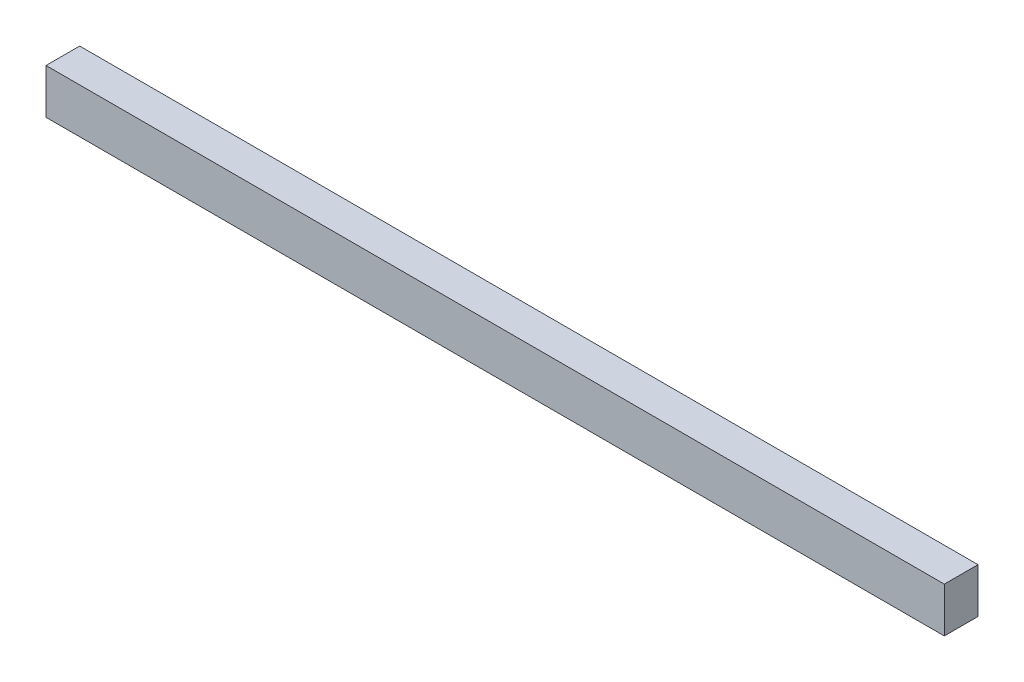
ISO-10303-21;
HEADER;
FILE_DESCRIPTION(('STEP AP214'),'2;1');
FILE_NAME('part.step','',(''),(''),'','','');
FILE_SCHEMA(('AUTOMOTIVE_DESIGN { 1 0 10303 214 1 1 1 1 }'));
ENDSEC;
DATA;
#1=APPLICATION_CONTEXT('core data for automotive mechanical design processes');
#2=APPLICATION_PROTOCOL_DEFINITION('international standard','automotive_design',2000,#1);
#3=PRODUCT_CONTEXT('',#1,'mechanical');
#4=PRODUCT('Part','Part','',(#3));
#5=PRODUCT_RELATED_PRODUCT_CATEGORY('part','',(#4));
#6=PRODUCT_DEFINITION_FORMATION('','',#4);
#7=PRODUCT_DEFINITION_CONTEXT('part definition',#1,'design');
#8=PRODUCT_DEFINITION('design','',#6,#7);
#9=PRODUCT_DEFINITION_SHAPE('','',#8);
#10=(LENGTH_UNIT() NAMED_UNIT(*) SI_UNIT(.MILLI.,.METRE.));
#11=(NAMED_UNIT(*) PLANE_ANGLE_UNIT() SI_UNIT($,.RADIAN.));
#12=(NAMED_UNIT(*) SI_UNIT($,.STERADIAN.) SOLID_ANGLE_UNIT());
#13=UNCERTAINTY_MEASURE_WITH_UNIT(LENGTH_MEASURE(1.E-05),#10,'distance_accuracy_value','');
#14=(GEOMETRIC_REPRESENTATION_CONTEXT(3) GLOBAL_UNCERTAINTY_ASSIGNED_CONTEXT((#13)) GLOBAL_UNIT_ASSIGNED_CONTEXT((#10,
#11,#12)) REPRESENTATION_CONTEXT('',''));
#15=CARTESIAN_POINT('',(0.,0.,0.));
#16=DIRECTION('',(0.,0.,1.));
#17=DIRECTION('',(1.,0.,0.));
#18=AXIS2_PLACEMENT_3D('',#15,#16,#17);
#19=CARTESIAN_POINT('',(200.,-10.,7.5));
#20=DIRECTION('',(-1.,0.,0.));
#21=DIRECTION('',(0.,0.,1.));
#22=AXIS2_PLACEMENT_3D('',#19,#20,#21);
#23=PLANE('',#22);
#24=DIRECTION('',(0.,1.,0.));
#25=VECTOR('',#24,1.);
#26=CARTESIAN_POINT('',(200.,-10.,-7.5));
#27=LINE('',#26,#25);
#28=CARTESIAN_POINT('',(200.,-10.,-7.5));
#29=VERTEX_POINT('',#28);
#30=CARTESIAN_POINT('',(200.,10.,-7.5));
#31=VERTEX_POINT('',#30);
#32=EDGE_CURVE('E102',#29,#31,#27,.T.);
#33=ORIENTED_EDGE('',*,*,#32,.T.);
#34=DIRECTION('',(0.,0.,-1.));
#35=VECTOR('',#34,1.);
#36=CARTESIAN_POINT('',(200.,10.,7.5));
#37=LINE('',#36,#35);
#38=CARTESIAN_POINT('',(200.,10.,7.5));
#39=VERTEX_POINT('',#38);
#40=EDGE_CURVE('E11',#39,#31,#37,.T.);
#41=ORIENTED_EDGE('',*,*,#40,.F.);
#42=DIRECTION('',(0.,1.,0.));
#43=VECTOR('',#42,1.);
#44=CARTESIAN_POINT('',(200.,-10.,7.5));
#45=LINE('',#44,#43);
#46=CARTESIAN_POINT('',(200.,-10.,7.5));
#47=VERTEX_POINT('',#46);
#48=EDGE_CURVE('E90',#47,#39,#45,.T.);
#49=ORIENTED_EDGE('',*,*,#48,.F.);
#50=DIRECTION('',(0.,0.,-1.));
#51=VECTOR('',#50,1.);
#52=CARTESIAN_POINT('',(200.,-10.,7.5));
#53=LINE('',#52,#51);
#54=EDGE_CURVE('E98',#47,#29,#53,.T.);
#55=ORIENTED_EDGE('',*,*,#54,.T.);
#56=EDGE_LOOP('',(#33,#41,#49,#55));
#57=FACE_BOUND('',#56,.T.);
#58=ADVANCED_FACE('F39',(#57),#23,.F.);
#59=CARTESIAN_POINT('',(-200.,10.,7.5));
#60=DIRECTION('',(0.,-1.,0.));
#61=DIRECTION('',(0.,0.,-1.));
#62=AXIS2_PLACEMENT_3D('',#59,#60,#61);
#63=PLANE('',#62);
#64=DIRECTION('',(-1.,0.,0.));
#65=VECTOR('',#64,1.);
#66=CARTESIAN_POINT('',(-200.,10.,-7.5));
#67=LINE('',#66,#65);
#68=CARTESIAN_POINT('',(-200.,10.,-7.5));
#69=VERTEX_POINT('',#68);
#70=EDGE_CURVE('E94',#31,#69,#67,.T.);
#71=ORIENTED_EDGE('',*,*,#70,.T.);
#72=DIRECTION('',(0.,0.,-1.));
#73=VECTOR('',#72,1.);
#74=CARTESIAN_POINT('',(-200.,10.,7.5));
#75=LINE('',#74,#73);
#76=CARTESIAN_POINT('',(-200.,10.,7.5));
#77=VERTEX_POINT('',#76);
#78=EDGE_CURVE('E47',#77,#69,#75,.T.);
#79=ORIENTED_EDGE('',*,*,#78,.F.);
#80=DIRECTION('',(-1.,0.,0.));
#81=VECTOR('',#80,1.);
#82=CARTESIAN_POINT('',(-200.,10.,7.5));
#83=LINE('',#82,#81);
#84=EDGE_CURVE('E85',#39,#77,#83,.T.);
#85=ORIENTED_EDGE('',*,*,#84,.F.);
#86=ORIENTED_EDGE('',*,*,#40,.T.);
#87=EDGE_LOOP('',(#71,#79,#85,#86));
#88=FACE_BOUND('',#87,.T.);
#89=ADVANCED_FACE('F93',(#88),#63,.F.);
#90=CARTESIAN_POINT('',(-200.,-10.,7.5));
#91=DIRECTION('',(1.,0.,0.));
#92=DIRECTION('',(0.,0.,-1.));
#93=AXIS2_PLACEMENT_3D('',#90,#91,#92);
#94=PLANE('',#93);
#95=DIRECTION('',(0.,-1.,0.));
#96=VECTOR('',#95,1.);
#97=CARTESIAN_POINT('',(-200.,-10.,-7.5));
#98=LINE('',#97,#96);
#99=CARTESIAN_POINT('',(-200.,-10.,-7.5));
#100=VERTEX_POINT('',#99);
#101=EDGE_CURVE('E72',#69,#100,#98,.T.);
#102=ORIENTED_EDGE('',*,*,#101,.T.);
#103=DIRECTION('',(0.,0.,-1.));
#104=VECTOR('',#103,1.);
#105=CARTESIAN_POINT('',(-200.,-10.,7.5));
#106=LINE('',#105,#104);
#107=CARTESIAN_POINT('',(-200.,-10.,7.5));
#108=VERTEX_POINT('',#107);
#109=EDGE_CURVE('E95',#108,#100,#106,.T.);
#110=ORIENTED_EDGE('',*,*,#109,.F.);
#111=DIRECTION('',(0.,-1.,0.));
#112=VECTOR('',#111,1.);
#113=CARTESIAN_POINT('',(-200.,-10.,7.5));
#114=LINE('',#113,#112);
#115=EDGE_CURVE('E88',#77,#108,#114,.T.);
#116=ORIENTED_EDGE('',*,*,#115,.F.);
#117=ORIENTED_EDGE('',*,*,#78,.T.);
#118=EDGE_LOOP('',(#102,#110,#116,#117));
#119=FACE_BOUND('',#118,.T.);
#120=ADVANCED_FACE('F96',(#119),#94,.F.);
#121=CARTESIAN_POINT('',(-200.,-10.,7.5));
#122=DIRECTION('',(0.,1.,0.));
#123=DIRECTION('',(0.,0.,1.));
#124=AXIS2_PLACEMENT_3D('',#121,#122,#123);
#125=PLANE('',#124);
#126=DIRECTION('',(1.,0.,0.));
#127=VECTOR('',#126,1.);
#128=CARTESIAN_POINT('',(-200.,-10.,-7.5));
#129=LINE('',#128,#127);
#130=EDGE_CURVE('E78',#100,#29,#129,.T.);
#131=ORIENTED_EDGE('',*,*,#130,.T.);
#132=ORIENTED_EDGE('',*,*,#54,.F.);
#133=DIRECTION('',(1.,0.,0.));
#134=VECTOR('',#133,1.);
#135=CARTESIAN_POINT('',(-200.,-10.,7.5));
#136=LINE('',#135,#134);
#137=EDGE_CURVE('E55',#108,#47,#136,.T.);
#138=ORIENTED_EDGE('',*,*,#137,.F.);
#139=ORIENTED_EDGE('',*,*,#109,.T.);
#140=EDGE_LOOP('',(#131,#132,#138,#139));
#141=FACE_BOUND('',#140,.T.);
#142=ADVANCED_FACE('F110',(#141),#125,.F.);
#143=CARTESIAN_POINT('',(0.,0.,7.5));
#144=DIRECTION('',(0.,0.,-1.));
#145=DIRECTION('',(-1.,0.,0.));
#146=AXIS2_PLACEMENT_3D('',#143,#144,#145);
#147=PLANE('',#146);
#148=ORIENTED_EDGE('',*,*,#48,.T.);
#149=ORIENTED_EDGE('',*,*,#84,.T.);
#150=ORIENTED_EDGE('',*,*,#115,.T.);
#151=ORIENTED_EDGE('',*,*,#137,.T.);
#152=EDGE_LOOP('',(#148,#149,#150,#151));
#153=FACE_BOUND('',#152,.T.);
#154=ADVANCED_FACE('F86',(#153),#147,.F.);
#155=CARTESIAN_POINT('',(0.,0.,-7.5));
#156=DIRECTION('',(0.,0.,-1.));
#157=DIRECTION('',(-1.,0.,0.));
#158=AXIS2_PLACEMENT_3D('',#155,#156,#157);
#159=PLANE('',#158);
#160=CARTESIAN_POINT('',(-192.5,0.,-7.5));
#161=DIRECTION('',(0.,0.,1.));
#162=DIRECTION('',(1.,0.,0.));
#163=AXIS2_PLACEMENT_3D('',#160,#161,#162);
#164=CIRCLE('',#163,3.99999999999999);
#165=CARTESIAN_POINT('',(-188.5,0.,-7.5));
#166=VERTEX_POINT('',#165);
#167=EDGE_CURVE('E122',#166,#166,#164,.T.);
#168=ORIENTED_EDGE('',*,*,#167,.T.);
#169=EDGE_LOOP('',(#168));
#170=FACE_BOUND('',#169,.T.);
#171=CARTESIAN_POINT('',(192.5,0.,-7.5));
#172=DIRECTION('',(0.,0.,-1.));
#173=DIRECTION('',(-1.,0.,0.));
#174=AXIS2_PLACEMENT_3D('',#171,#172,#173);
#175=CIRCLE('',#174,3.99999999999999);
#176=CARTESIAN_POINT('',(188.5,0.,-7.5));
#177=VERTEX_POINT('',#176);
#178=EDGE_CURVE('E116',#177,#177,#175,.T.);
#179=ORIENTED_EDGE('',*,*,#178,.F.);
#180=EDGE_LOOP('',(#179));
#181=FACE_BOUND('',#180,.T.);
#182=ORIENTED_EDGE('',*,*,#32,.F.);
#183=ORIENTED_EDGE('',*,*,#130,.F.);
#184=ORIENTED_EDGE('',*,*,#101,.F.);
#185=ORIENTED_EDGE('',*,*,#70,.F.);
#186=EDGE_LOOP('',(#182,#183,#184,#185));
#187=FACE_BOUND('',#186,.T.);
#188=ADVANCED_FACE('F113',(#170,#181,#187),#159,.T.);
#189=CARTESIAN_POINT('',(192.5,0.,2.5));
#190=DIRECTION('',(0.,0.,-1.));
#191=DIRECTION('',(-1.,0.,0.));
#192=AXIS2_PLACEMENT_3D('',#189,#190,#191);
#193=CYLINDRICAL_SURFACE('',#192,3.99999999999999);
#194=CARTESIAN_POINT('',(192.5,0.,2.5));
#195=DIRECTION('',(0.,0.,-1.));
#196=DIRECTION('',(-1.,0.,0.));
#197=AXIS2_PLACEMENT_3D('',#194,#195,#196);
#198=CIRCLE('',#197,3.99999999999999);
#199=CARTESIAN_POINT('',(188.5,0.,2.5));
#200=VERTEX_POINT('',#199);
#201=EDGE_CURVE('E105',#200,#200,#198,.T.);
#202=ORIENTED_EDGE('',*,*,#201,.F.);
#203=EDGE_LOOP('',(#202));
#204=FACE_BOUND('',#203,.T.);
#205=ORIENTED_EDGE('',*,*,#178,.T.);
#206=EDGE_LOOP('',(#205));
#207=FACE_BOUND('',#206,.T.);
#208=ADVANCED_FACE('F152',(#204,#207),#193,.F.);
#209=CARTESIAN_POINT('',(192.5,0.,2.5));
#210=DIRECTION('',(0.,0.,-1.));
#211=DIRECTION('',(-1.,0.,0.));
#212=AXIS2_PLACEMENT_3D('',#209,#210,#211);
#213=PLANE('',#212);
#214=ORIENTED_EDGE('',*,*,#201,.T.);
#215=EDGE_LOOP('',(#214));
#216=FACE_BOUND('',#215,.T.);
#217=ADVANCED_FACE('F137',(#216),#213,.T.);
#218=CARTESIAN_POINT('',(-192.5,0.,2.5));
#219=DIRECTION('',(0.,0.,-1.));
#220=DIRECTION('',(-1.,0.,0.));
#221=AXIS2_PLACEMENT_3D('',#218,#219,#220);
#222=CYLINDRICAL_SURFACE('',#221,3.99999999999999);
#223=CARTESIAN_POINT('',(-192.5,0.,2.5));
#224=DIRECTION('',(0.,0.,1.));
#225=DIRECTION('',(1.,0.,0.));
#226=AXIS2_PLACEMENT_3D('',#223,#224,#225);
#227=CIRCLE('',#226,3.99999999999999);
#228=CARTESIAN_POINT('',(-188.5,0.,2.5));
#229=VERTEX_POINT('',#228);
#230=EDGE_CURVE('E119',#229,#229,#227,.T.);
#231=ORIENTED_EDGE('',*,*,#230,.T.);
#232=EDGE_LOOP('',(#231));
#233=FACE_BOUND('',#232,.T.);
#234=ORIENTED_EDGE('',*,*,#167,.F.);
#235=EDGE_LOOP('',(#234));
#236=FACE_BOUND('',#235,.T.);
#237=ADVANCED_FACE('F128',(#233,#236),#222,.F.);
#238=CARTESIAN_POINT('',(-192.5,0.,2.5));
#239=DIRECTION('',(0.,0.,-1.));
#240=DIRECTION('',(1.,0.,0.));
#241=AXIS2_PLACEMENT_3D('',#238,#239,#240);
#242=PLANE('',#241);
#243=ORIENTED_EDGE('',*,*,#230,.F.);
#244=EDGE_LOOP('',(#243));
#245=FACE_BOUND('',#244,.T.);
#246=ADVANCED_FACE('F131',(#245),#242,.T.);
#247=CLOSED_SHELL('',(#58,#89,#120,#142,#154,#188,#208,#217,#237,#246));
#248=MANIFOLD_SOLID_BREP('B2',#247);
#249=ADVANCED_BREP_SHAPE_REPRESENTATION('',(#18,#248),#14);
#250=SHAPE_DEFINITION_REPRESENTATION(#9,#249);
ENDSEC;
END-ISO-10303-21;
